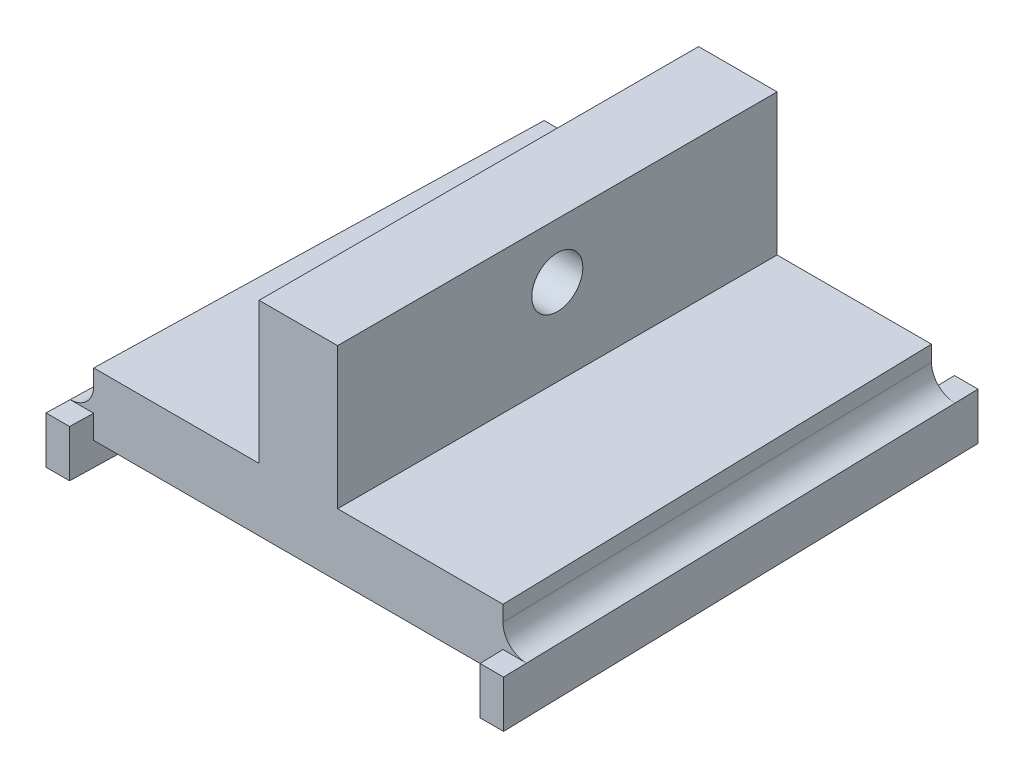
ISO-10303-21;
HEADER;
FILE_DESCRIPTION(('STEP AP214'),'2;1');
FILE_NAME('part.step','',(''),(''),'','','');
FILE_SCHEMA(('AUTOMOTIVE_DESIGN { 1 0 10303 214 1 1 1 1 }'));
ENDSEC;
DATA;
#1=APPLICATION_CONTEXT('core data for automotive mechanical design processes');
#2=APPLICATION_PROTOCOL_DEFINITION('international standard','automotive_design',2000,#1);
#3=PRODUCT_CONTEXT('',#1,'mechanical');
#4=PRODUCT('Part','Part','',(#3));
#5=PRODUCT_RELATED_PRODUCT_CATEGORY('part','',(#4));
#6=PRODUCT_DEFINITION_FORMATION('','',#4);
#7=PRODUCT_DEFINITION_CONTEXT('part definition',#1,'design');
#8=PRODUCT_DEFINITION('design','',#6,#7);
#9=PRODUCT_DEFINITION_SHAPE('','',#8);
#10=(LENGTH_UNIT() NAMED_UNIT(*) SI_UNIT(.MILLI.,.METRE.));
#11=(NAMED_UNIT(*) PLANE_ANGLE_UNIT() SI_UNIT($,.RADIAN.));
#12=(NAMED_UNIT(*) SI_UNIT($,.STERADIAN.) SOLID_ANGLE_UNIT());
#13=UNCERTAINTY_MEASURE_WITH_UNIT(LENGTH_MEASURE(1.E-05),#10,'distance_accuracy_value','');
#14=(GEOMETRIC_REPRESENTATION_CONTEXT(3) GLOBAL_UNCERTAINTY_ASSIGNED_CONTEXT((#13)) GLOBAL_UNIT_ASSIGNED_CONTEXT((#10,
#11,#12)) REPRESENTATION_CONTEXT('',''));
#15=CARTESIAN_POINT('',(0.,0.,0.));
#16=DIRECTION('',(0.,0.,1.));
#17=DIRECTION('',(1.,0.,0.));
#18=AXIS2_PLACEMENT_3D('',#15,#16,#17);
#19=CARTESIAN_POINT('',(0.,3.,0.));
#20=DIRECTION('',(0.,-1.,0.));
#21=DIRECTION('',(0.,0.,-1.));
#22=AXIS2_PLACEMENT_3D('',#19,#20,#21);
#23=PLANE('',#22);
#24=DIRECTION('',(0.0249921911602069,0.,0.999687646408123));
#25=VECTOR('',#24,1.);
#26=CARTESIAN_POINT('',(10.9965641104894,3.,-0.274914102762275));
#27=LINE('',#26,#25);
#28=CARTESIAN_POINT('',(11.2034369630584,3.,8.));
#29=VERTEX_POINT('',#28);
#30=CARTESIAN_POINT('',(11.2784369630585,3.,11.));
#31=VERTEX_POINT('',#30);
#32=EDGE_CURVE('E219',#29,#31,#27,.T.);
#33=ORIENTED_EDGE('',*,*,#32,.F.);
#34=DIRECTION('',(-1.,0.,0.));
#35=VECTOR('',#34,1.);
#36=CARTESIAN_POINT('',(0.,3.,8.));
#37=LINE('',#36,#35);
#38=CARTESIAN_POINT('',(8.20249960949705,3.,8.));
#39=VERTEX_POINT('',#38);
#40=EDGE_CURVE('E406',#29,#39,#37,.T.);
#41=ORIENTED_EDGE('',*,*,#40,.T.);
#42=DIRECTION('',(0.0249921911602069,0.,0.999687646408123));
#43=VECTOR('',#42,1.);
#44=CARTESIAN_POINT('',(7.99750117126498,3.,-0.199937529281655));
#45=LINE('',#44,#43);
#46=CARTESIAN_POINT('',(8.27749960949706,3.,11.));
#47=VERTEX_POINT('',#46);
#48=EDGE_CURVE('E212',#39,#47,#45,.T.);
#49=ORIENTED_EDGE('',*,*,#48,.T.);
#50=DIRECTION('',(-1.,0.,0.));
#51=VECTOR('',#50,1.);
#52=CARTESIAN_POINT('',(0.,3.,11.));
#53=LINE('',#52,#51);
#54=EDGE_CURVE('E226',#31,#47,#53,.T.);
#55=ORIENTED_EDGE('',*,*,#54,.F.);
#56=EDGE_LOOP('',(#33,#41,#49,#55));
#57=FACE_BOUND('',#56,.T.);
#58=ADVANCED_FACE('F41',(#57),#23,.F.);
#59=CARTESIAN_POINT('',(0.,3.,0.));
#60=DIRECTION('',(0.,-1.,0.));
#61=DIRECTION('',(0.,0.,-1.));
#62=AXIS2_PLACEMENT_3D('',#59,#60,#61);
#63=PLANE('',#62);
#64=DIRECTION('',(-0.0249921911601995,0.,0.999687646408123));
#65=VECTOR('',#64,1.);
#66=CARTESIAN_POINT('',(-43.7251713773862,3.,-1.0931292844345));
#67=LINE('',#66,#65);
#68=CARTESIAN_POINT('',(-43.952499609497,3.,8.));
#69=VERTEX_POINT('',#68);
#70=CARTESIAN_POINT('',(-44.027499609497,3.,11.));
#71=VERTEX_POINT('',#70);
#72=EDGE_CURVE('E270',#69,#71,#67,.T.);
#73=ORIENTED_EDGE('',*,*,#72,.F.);
#74=DIRECTION('',(-1.,0.,0.));
#75=VECTOR('',#74,1.);
#76=CARTESIAN_POINT('',(0.,3.,8.));
#77=LINE('',#76,#75);
#78=CARTESIAN_POINT('',(-46.9534369630584,3.,8.));
#79=VERTEX_POINT('',#78);
#80=EDGE_CURVE('E64',#69,#79,#77,.T.);
#81=ORIENTED_EDGE('',*,*,#80,.T.);
#82=DIRECTION('',(0.0249921911601994,0.,-0.999687646408123));
#83=VECTOR('',#82,1.);
#84=CARTESIAN_POINT('',(-46.7242343166105,3.,-1.16810585791509));
#85=LINE('',#84,#83);
#86=CARTESIAN_POINT('',(-47.0284369630584,3.,11.));
#87=VERTEX_POINT('',#86);
#88=EDGE_CURVE('E280',#87,#79,#85,.T.);
#89=ORIENTED_EDGE('',*,*,#88,.F.);
#90=DIRECTION('',(-1.,0.,0.));
#91=VECTOR('',#90,1.);
#92=CARTESIAN_POINT('',(0.,3.,11.));
#93=LINE('',#92,#91);
#94=EDGE_CURVE('E275',#71,#87,#93,.T.);
#95=ORIENTED_EDGE('',*,*,#94,.F.);
#96=EDGE_LOOP('',(#73,#81,#89,#95));
#97=FACE_BOUND('',#96,.T.);
#98=ADVANCED_FACE('F469',(#97),#63,.F.);
#99=CARTESIAN_POINT('',(-43.952499609497,8.,8.));
#100=DIRECTION('',(-0.999687646408123,0.,-0.0249921911601993));
#101=DIRECTION('',(-0.0249921911601993,0.,0.999687646408123));
#102=AXIS2_PLACEMENT_3D('',#99,#100,#101);
#103=PLANE('',#102);
#104=DIRECTION('',(0.,-1.,0.));
#105=VECTOR('',#104,1.);
#106=CARTESIAN_POINT('',(-42.5524996094972,8.,-48.));
#107=LINE('',#106,#105);
#108=CARTESIAN_POINT('',(-42.5524996094972,8.,-48.));
#109=VERTEX_POINT('',#108);
#110=CARTESIAN_POINT('',(-42.5524996094972,6.,-48.));
#111=VERTEX_POINT('',#110);
#112=EDGE_CURVE('E382',#109,#111,#107,.T.);
#113=ORIENTED_EDGE('',*,*,#112,.T.);
#114=DIRECTION('',(-0.0249921911601993,0.,0.999687646408123));
#115=VECTOR('',#114,1.);
#116=CARTESIAN_POINT('',(-43.952499609497,6.,8.));
#117=LINE('',#116,#115);
#118=CARTESIAN_POINT('',(-43.952499609497,6.,8.));
#119=VERTEX_POINT('',#118);
#120=EDGE_CURVE('E381',#111,#119,#117,.T.);
#121=ORIENTED_EDGE('',*,*,#120,.T.);
#122=DIRECTION('',(0.,-1.,0.));
#123=VECTOR('',#122,1.);
#124=CARTESIAN_POINT('',(-43.952499609497,8.,8.));
#125=LINE('',#124,#123);
#126=CARTESIAN_POINT('',(-43.952499609497,8.,8.));
#127=VERTEX_POINT('',#126);
#128=EDGE_CURVE('E387',#127,#119,#125,.T.);
#129=ORIENTED_EDGE('',*,*,#128,.F.);
#130=DIRECTION('',(0.0249921911601993,0.,-0.999687646408123));
#131=VECTOR('',#130,1.);
#132=CARTESIAN_POINT('',(-43.952499609497,8.,8.));
#133=LINE('',#132,#131);
#134=EDGE_CURVE('E353',#127,#109,#133,.T.);
#135=ORIENTED_EDGE('',*,*,#134,.T.);
#136=EDGE_LOOP('',(#113,#121,#129,#135));
#137=FACE_BOUND('',#136,.T.);
#138=ADVANCED_FACE('F481',(#137),#103,.T.);
#139=CARTESIAN_POINT('',(0.,8.,0.));
#140=DIRECTION('',(0.,-1.,0.));
#141=DIRECTION('',(0.,0.,-1.));
#142=AXIS2_PLACEMENT_3D('',#139,#140,#141);
#143=PLANE('',#142);
#144=DIRECTION('',(0.,0.,1.));
#145=VECTOR('',#144,1.);
#146=CARTESIAN_POINT('',(-22.8750000000002,8.,8.));
#147=LINE('',#146,#145);
#148=CARTESIAN_POINT('',(-22.8750000000002,8.,-48.));
#149=VERTEX_POINT('',#148);
#150=CARTESIAN_POINT('',(-22.8750000000002,8.,8.));
#151=VERTEX_POINT('',#150);
#152=EDGE_CURVE('E305',#149,#151,#147,.T.);
#153=ORIENTED_EDGE('',*,*,#152,.F.);
#154=DIRECTION('',(1.,0.,0.));
#155=VECTOR('',#154,1.);
#156=CARTESIAN_POINT('',(-42.5524996094972,8.,-48.));
#157=LINE('',#156,#155);
#158=EDGE_CURVE('E358',#109,#149,#157,.T.);
#159=ORIENTED_EDGE('',*,*,#158,.F.);
#160=ORIENTED_EDGE('',*,*,#134,.F.);
#161=DIRECTION('',(-1.,0.,0.));
#162=VECTOR('',#161,1.);
#163=CARTESIAN_POINT('',(8.20249960949705,8.,8.));
#164=LINE('',#163,#162);
#165=EDGE_CURVE('E347',#151,#127,#164,.T.);
#166=ORIENTED_EDGE('',*,*,#165,.F.);
#167=EDGE_LOOP('',(#153,#159,#160,#166));
#168=FACE_BOUND('',#167,.T.);
#169=ADVANCED_FACE('F486',(#168),#143,.F.);
#170=DIRECTION('',(0.,0.,-1.));
#171=VECTOR('',#170,1.);
#172=CARTESIAN_POINT('',(-12.8750000000002,8.,-48.));
#173=LINE('',#172,#171);
#174=CARTESIAN_POINT('',(-12.8750000000002,8.,8.));
#175=VERTEX_POINT('',#174);
#176=CARTESIAN_POINT('',(-12.8750000000002,8.,-48.));
#177=VERTEX_POINT('',#176);
#178=EDGE_CURVE('E311',#175,#177,#173,.T.);
#179=ORIENTED_EDGE('',*,*,#178,.F.);
#180=CARTESIAN_POINT('',(8.20249960949705,8.,8.));
#181=VERTEX_POINT('',#180);
#182=EDGE_CURVE('E349',#181,#175,#164,.T.);
#183=ORIENTED_EDGE('',*,*,#182,.F.);
#184=DIRECTION('',(0.0249921911602069,0.,0.999687646408123));
#185=VECTOR('',#184,1.);
#186=CARTESIAN_POINT('',(6.80249960949684,8.,-48.));
#187=LINE('',#186,#185);
#188=CARTESIAN_POINT('',(6.80249960949684,8.,-48.));
#189=VERTEX_POINT('',#188);
#190=EDGE_CURVE('E343',#189,#181,#187,.T.);
#191=ORIENTED_EDGE('',*,*,#190,.F.);
#192=EDGE_CURVE('E357',#177,#189,#157,.T.);
#193=ORIENTED_EDGE('',*,*,#192,.F.);
#194=EDGE_LOOP('',(#179,#183,#191,#193));
#195=FACE_BOUND('',#194,.T.);
#196=ADVANCED_FACE('F501',(#195),#143,.F.);
#197=CARTESIAN_POINT('',(6.80249960949684,8.,-48.));
#198=DIRECTION('',(0.999687646408123,0.,-0.0249921911602069));
#199=DIRECTION('',(-0.0249921911602069,0.,-0.999687646408123));
#200=AXIS2_PLACEMENT_3D('',#197,#198,#199);
#201=PLANE('',#200);
#202=DIRECTION('',(0.,-1.,0.));
#203=VECTOR('',#202,1.);
#204=CARTESIAN_POINT('',(8.20249960949705,8.,8.));
#205=LINE('',#204,#203);
#206=CARTESIAN_POINT('',(8.20249960949705,6.,8.));
#207=VERTEX_POINT('',#206);
#208=EDGE_CURVE('E392',#181,#207,#205,.T.);
#209=ORIENTED_EDGE('',*,*,#208,.T.);
#210=DIRECTION('',(0.0249921911602069,0.,0.999687646408123));
#211=VECTOR('',#210,1.);
#212=CARTESIAN_POINT('',(6.80249960949684,6.,-48.));
#213=LINE('',#212,#211);
#214=CARTESIAN_POINT('',(6.80249960949684,6.,-48.));
#215=VERTEX_POINT('',#214);
#216=EDGE_CURVE('E409',#207,#215,#213,.F.);
#217=ORIENTED_EDGE('',*,*,#216,.T.);
#218=DIRECTION('',(0.,-1.,0.));
#219=VECTOR('',#218,1.);
#220=CARTESIAN_POINT('',(6.80249960949684,8.,-48.));
#221=LINE('',#220,#219);
#222=EDGE_CURVE('E377',#189,#215,#221,.T.);
#223=ORIENTED_EDGE('',*,*,#222,.F.);
#224=ORIENTED_EDGE('',*,*,#190,.T.);
#225=EDGE_LOOP('',(#209,#217,#223,#224));
#226=FACE_BOUND('',#225,.T.);
#227=ADVANCED_FACE('F427',(#226),#201,.T.);
#228=CARTESIAN_POINT('',(-42.5524996094972,8.,-48.));
#229=DIRECTION('',(0.,0.,-1.));
#230=DIRECTION('',(-1.,0.,0.));
#231=AXIS2_PLACEMENT_3D('',#228,#229,#230);
#232=PLANE('',#231);
#233=DIRECTION('',(1.,0.,0.));
#234=VECTOR('',#233,1.);
#235=CARTESIAN_POINT('',(-42.5524996094972,0.,-48.));
#236=LINE('',#235,#234);
#237=CARTESIAN_POINT('',(-42.5524996094972,0.,-48.));
#238=VERTEX_POINT('',#237);
#239=CARTESIAN_POINT('',(6.80249960949684,0.,-48.));
#240=VERTEX_POINT('',#239);
#241=EDGE_CURVE('E348',#238,#240,#236,.T.);
#242=ORIENTED_EDGE('',*,*,#241,.F.);
#243=CARTESIAN_POINT('',(-42.5524996094972,3.,-48.));
#244=VERTEX_POINT('',#243);
#245=EDGE_CURVE('E386',#244,#238,#107,.T.);
#246=ORIENTED_EDGE('',*,*,#245,.F.);
#247=DIRECTION('',(1.,0.,0.));
#248=VECTOR('',#247,1.);
#249=CARTESIAN_POINT('',(0.,3.,-48.));
#250=LINE('',#249,#248);
#251=CARTESIAN_POINT('',(-45.5534369630586,3.,-48.));
#252=VERTEX_POINT('',#251);
#253=EDGE_CURVE('E399',#252,#244,#250,.T.);
#254=ORIENTED_EDGE('',*,*,#253,.F.);
#255=CARTESIAN_POINT('',(-45.5534369630586,6.,-48.));
#256=DIRECTION('',(0.,0.,-1.));
#257=DIRECTION('',(-1.,0.,0.));
#258=AXIS2_PLACEMENT_3D('',#255,#256,#257);
#259=ELLIPSE('',#258,3.00093735356138,3.);
#260=EDGE_CURVE('E415',#252,#111,#259,.F.);
#261=ORIENTED_EDGE('',*,*,#260,.T.);
#262=ORIENTED_EDGE('',*,*,#112,.F.);
#263=ORIENTED_EDGE('',*,*,#158,.T.);
#264=DIRECTION('',(0.,-1.,0.));
#265=VECTOR('',#264,1.);
#266=CARTESIAN_POINT('',(-22.8750000000002,26.,-48.));
#267=LINE('',#266,#265);
#268=CARTESIAN_POINT('',(-22.8750000000002,26.,-48.));
#269=VERTEX_POINT('',#268);
#270=EDGE_CURVE('E320',#269,#149,#267,.T.);
#271=ORIENTED_EDGE('',*,*,#270,.F.);
#272=DIRECTION('',(-1.,0.,0.));
#273=VECTOR('',#272,1.);
#274=CARTESIAN_POINT('',(-22.8750000000002,26.,-48.));
#275=LINE('',#274,#273);
#276=CARTESIAN_POINT('',(-12.8750000000002,26.,-48.));
#277=VERTEX_POINT('',#276);
#278=EDGE_CURVE('E317',#277,#269,#275,.T.);
#279=ORIENTED_EDGE('',*,*,#278,.F.);
#280=DIRECTION('',(0.,-1.,0.));
#281=VECTOR('',#280,1.);
#282=CARTESIAN_POINT('',(-12.8750000000002,26.,-48.));
#283=LINE('',#282,#281);
#284=EDGE_CURVE('E330',#277,#177,#283,.T.);
#285=ORIENTED_EDGE('',*,*,#284,.T.);
#286=ORIENTED_EDGE('',*,*,#192,.T.);
#287=ORIENTED_EDGE('',*,*,#222,.T.);
#288=CARTESIAN_POINT('',(9.80343696305823,6.,-48.));
#289=DIRECTION('',(0.,0.,-1.));
#290=DIRECTION('',(1.,0.,0.));
#291=AXIS2_PLACEMENT_3D('',#288,#289,#290);
#292=ELLIPSE('',#291,3.00093735356138,3.);
#293=CARTESIAN_POINT('',(9.80343696305822,3.,-48.));
#294=VERTEX_POINT('',#293);
#295=EDGE_CURVE('E11',#215,#294,#292,.F.);
#296=ORIENTED_EDGE('',*,*,#295,.T.);
#297=DIRECTION('',(1.,0.,0.));
#298=VECTOR('',#297,1.);
#299=CARTESIAN_POINT('',(0.,3.,-48.));
#300=LINE('',#299,#298);
#301=CARTESIAN_POINT('',(6.80249960949684,3.,-48.));
#302=VERTEX_POINT('',#301);
#303=EDGE_CURVE('E56',#302,#294,#300,.T.);
#304=ORIENTED_EDGE('',*,*,#303,.F.);
#305=EDGE_CURVE('E209',#302,#240,#221,.T.);
#306=ORIENTED_EDGE('',*,*,#305,.T.);
#307=EDGE_LOOP('',(#242,#246,#254,#261,#262,#263,#271,#279,#285,#286,#287,#296,#304,#306));
#308=FACE_BOUND('',#307,.T.);
#309=ADVANCED_FACE('F433',(#308),#232,.T.);
#310=CARTESIAN_POINT('',(8.20249960949705,8.,8.));
#311=DIRECTION('',(0.,0.,1.));
#312=DIRECTION('',(1.,0.,0.));
#313=AXIS2_PLACEMENT_3D('',#310,#311,#312);
#314=PLANE('',#313);
#315=DIRECTION('',(-1.,0.,0.));
#316=VECTOR('',#315,1.);
#317=CARTESIAN_POINT('',(8.20249960949705,0.,8.));
#318=LINE('',#317,#316);
#319=CARTESIAN_POINT('',(8.20249960949705,0.,8.));
#320=VERTEX_POINT('',#319);
#321=CARTESIAN_POINT('',(-43.952499609497,0.,8.));
#322=VERTEX_POINT('',#321);
#323=EDGE_CURVE('E366',#320,#322,#318,.T.);
#324=ORIENTED_EDGE('',*,*,#323,.F.);
#325=EDGE_CURVE('E362',#39,#320,#205,.T.);
#326=ORIENTED_EDGE('',*,*,#325,.F.);
#327=ORIENTED_EDGE('',*,*,#40,.F.);
#328=CARTESIAN_POINT('',(11.2034369630584,6.,8.));
#329=DIRECTION('',(0.,0.,1.));
#330=DIRECTION('',(1.,0.,0.));
#331=AXIS2_PLACEMENT_3D('',#328,#329,#330);
#332=ELLIPSE('',#331,3.00093735356138,3.);
#333=EDGE_CURVE('E50',#29,#207,#332,.F.);
#334=ORIENTED_EDGE('',*,*,#333,.T.);
#335=ORIENTED_EDGE('',*,*,#208,.F.);
#336=ORIENTED_EDGE('',*,*,#182,.T.);
#337=DIRECTION('',(0.,-1.,0.));
#338=VECTOR('',#337,1.);
#339=CARTESIAN_POINT('',(-12.8750000000002,26.,8.));
#340=LINE('',#339,#338);
#341=CARTESIAN_POINT('',(-12.8750000000002,26.,8.));
#342=VERTEX_POINT('',#341);
#343=EDGE_CURVE('E334',#342,#175,#340,.T.);
#344=ORIENTED_EDGE('',*,*,#343,.F.);
#345=DIRECTION('',(1.,0.,0.));
#346=VECTOR('',#345,1.);
#347=CARTESIAN_POINT('',(-12.8750000000002,26.,8.));
#348=LINE('',#347,#346);
#349=CARTESIAN_POINT('',(-22.8750000000002,26.,8.));
#350=VERTEX_POINT('',#349);
#351=EDGE_CURVE('E310',#350,#342,#348,.T.);
#352=ORIENTED_EDGE('',*,*,#351,.F.);
#353=DIRECTION('',(0.,-1.,0.));
#354=VECTOR('',#353,1.);
#355=CARTESIAN_POINT('',(-22.8750000000002,26.,8.));
#356=LINE('',#355,#354);
#357=EDGE_CURVE('E338',#350,#151,#356,.T.);
#358=ORIENTED_EDGE('',*,*,#357,.T.);
#359=ORIENTED_EDGE('',*,*,#165,.T.);
#360=ORIENTED_EDGE('',*,*,#128,.T.);
#361=CARTESIAN_POINT('',(-46.9534369630584,6.,8.));
#362=DIRECTION('',(0.,0.,1.));
#363=DIRECTION('',(-1.,0.,0.));
#364=AXIS2_PLACEMENT_3D('',#361,#362,#363);
#365=ELLIPSE('',#364,3.00093735356138,3.);
#366=EDGE_CURVE('E412',#119,#79,#365,.F.);
#367=ORIENTED_EDGE('',*,*,#366,.T.);
#368=ORIENTED_EDGE('',*,*,#80,.F.);
#369=EDGE_CURVE('E391',#69,#322,#125,.T.);
#370=ORIENTED_EDGE('',*,*,#369,.T.);
#371=EDGE_LOOP('',(#324,#326,#327,#334,#335,#336,#344,#352,#358,#359,#360,#367,#368,#370));
#372=FACE_BOUND('',#371,.T.);
#373=ADVANCED_FACE('F419',(#372),#314,.T.);
#374=CARTESIAN_POINT('',(0.,0.,0.));
#375=DIRECTION('',(0.,-1.,0.));
#376=DIRECTION('',(0.,0.,-1.));
#377=AXIS2_PLACEMENT_3D('',#374,#375,#376);
#378=PLANE('',#377);
#379=DIRECTION('',(0.0249921911602069,0.,0.999687646408123));
#380=VECTOR('',#379,1.);
#381=CARTESIAN_POINT('',(6.80249960949684,0.,-48.));
#382=LINE('',#381,#380);
#383=EDGE_CURVE('E342',#240,#320,#382,.T.);
#384=ORIENTED_EDGE('',*,*,#383,.T.);
#385=ORIENTED_EDGE('',*,*,#323,.T.);
#386=DIRECTION('',(0.0249921911601993,0.,-0.999687646408123));
#387=VECTOR('',#386,1.);
#388=CARTESIAN_POINT('',(-43.952499609497,0.,8.));
#389=LINE('',#388,#387);
#390=EDGE_CURVE('E370',#322,#238,#389,.T.);
#391=ORIENTED_EDGE('',*,*,#390,.T.);
#392=ORIENTED_EDGE('',*,*,#241,.T.);
#393=EDGE_LOOP('',(#384,#385,#391,#392));
#394=FACE_BOUND('',#393,.T.);
#395=ADVANCED_FACE('F560',(#394),#378,.T.);
#396=CARTESIAN_POINT('',(-22.8750000000002,26.,8.));
#397=DIRECTION('',(1.,0.,0.));
#398=DIRECTION('',(0.,0.,-1.));
#399=AXIS2_PLACEMENT_3D('',#396,#397,#398);
#400=PLANE('',#399);
#401=CARTESIAN_POINT('',(-22.8750000000002,19.,-20.));
#402=DIRECTION('',(1.,0.,0.));
#403=DIRECTION('',(0.,0.,-1.));
#404=AXIS2_PLACEMENT_3D('',#401,#402,#403);
#405=CIRCLE('',#404,3.25);
#406=CARTESIAN_POINT('',(-22.8750000000002,19.,-23.25));
#407=VERTEX_POINT('',#406);
#408=EDGE_CURVE('E301',#407,#407,#405,.T.);
#409=ORIENTED_EDGE('',*,*,#408,.T.);
#410=EDGE_LOOP('',(#409));
#411=FACE_BOUND('',#410,.T.);
#412=ORIENTED_EDGE('',*,*,#152,.T.);
#413=ORIENTED_EDGE('',*,*,#357,.F.);
#414=DIRECTION('',(0.,0.,1.));
#415=VECTOR('',#414,1.);
#416=CARTESIAN_POINT('',(-22.8750000000002,26.,8.));
#417=LINE('',#416,#415);
#418=EDGE_CURVE('E306',#269,#350,#417,.T.);
#419=ORIENTED_EDGE('',*,*,#418,.F.);
#420=ORIENTED_EDGE('',*,*,#270,.T.);
#421=EDGE_LOOP('',(#412,#413,#419,#420));
#422=FACE_BOUND('',#421,.T.);
#423=ADVANCED_FACE('F491',(#411,#422),#400,.F.);
#424=CARTESIAN_POINT('',(-12.8750000000002,26.,-48.));
#425=DIRECTION('',(-1.,0.,0.));
#426=DIRECTION('',(0.,0.,1.));
#427=AXIS2_PLACEMENT_3D('',#424,#425,#426);
#428=PLANE('',#427);
#429=CARTESIAN_POINT('',(-12.8750000000002,19.,-20.));
#430=DIRECTION('',(1.,0.,0.));
#431=DIRECTION('',(0.,0.,-1.));
#432=AXIS2_PLACEMENT_3D('',#429,#430,#431);
#433=CIRCLE('',#432,3.25);
#434=CARTESIAN_POINT('',(-12.8750000000002,19.,-23.25));
#435=VERTEX_POINT('',#434);
#436=EDGE_CURVE('E289',#435,#435,#433,.T.);
#437=ORIENTED_EDGE('',*,*,#436,.F.);
#438=EDGE_LOOP('',(#437));
#439=FACE_BOUND('',#438,.T.);
#440=ORIENTED_EDGE('',*,*,#178,.T.);
#441=ORIENTED_EDGE('',*,*,#284,.F.);
#442=DIRECTION('',(0.,0.,-1.));
#443=VECTOR('',#442,1.);
#444=CARTESIAN_POINT('',(-12.8750000000002,26.,-48.));
#445=LINE('',#444,#443);
#446=EDGE_CURVE('E314',#342,#277,#445,.T.);
#447=ORIENTED_EDGE('',*,*,#446,.F.);
#448=ORIENTED_EDGE('',*,*,#343,.T.);
#449=EDGE_LOOP('',(#440,#441,#447,#448));
#450=FACE_BOUND('',#449,.T.);
#451=ADVANCED_FACE('F499',(#439,#450),#428,.F.);
#452=CARTESIAN_POINT('',(0.,26.,0.));
#453=DIRECTION('',(0.,-1.,0.));
#454=DIRECTION('',(0.,0.,-1.));
#455=AXIS2_PLACEMENT_3D('',#452,#453,#454);
#456=PLANE('',#455);
#457=ORIENTED_EDGE('',*,*,#418,.T.);
#458=ORIENTED_EDGE('',*,*,#351,.T.);
#459=ORIENTED_EDGE('',*,*,#446,.T.);
#460=ORIENTED_EDGE('',*,*,#278,.T.);
#461=EDGE_LOOP('',(#457,#458,#459,#460));
#462=FACE_BOUND('',#461,.T.);
#463=ADVANCED_FACE('F494',(#462),#456,.F.);
#464=CARTESIAN_POINT('',(-30.8750000000002,19.,-20.));
#465=DIRECTION('',(1.,0.,0.));
#466=DIRECTION('',(0.,0.,-1.));
#467=AXIS2_PLACEMENT_3D('',#464,#465,#466);
#468=CYLINDRICAL_SURFACE('',#467,3.25);
#469=ORIENTED_EDGE('',*,*,#436,.T.);
#470=EDGE_LOOP('',(#469));
#471=FACE_BOUND('',#470,.T.);
#472=ORIENTED_EDGE('',*,*,#408,.F.);
#473=EDGE_LOOP('',(#472));
#474=FACE_BOUND('',#473,.T.);
#475=ADVANCED_FACE('F548',(#471,#474),#468,.F.);
#476=CARTESIAN_POINT('',(-43.7251713773862,3.,-1.0931292844345));
#477=DIRECTION('',(0.999687646408123,0.,0.0249921911601995));
#478=DIRECTION('',(0.0249921911601995,0.,-0.999687646408123));
#479=AXIS2_PLACEMENT_3D('',#476,#477,#478);
#480=PLANE('',#479);
#481=ORIENTED_EDGE('',*,*,#369,.F.);
#482=ORIENTED_EDGE('',*,*,#72,.T.);
#483=DIRECTION('',(0.,-1.,0.));
#484=VECTOR('',#483,1.);
#485=CARTESIAN_POINT('',(-44.027499609497,3.,11.));
#486=LINE('',#485,#484);
#487=CARTESIAN_POINT('',(-44.027499609497,-3.,11.));
#488=VERTEX_POINT('',#487);
#489=EDGE_CURVE('E293',#71,#488,#486,.T.);
#490=ORIENTED_EDGE('',*,*,#489,.T.);
#491=DIRECTION('',(-0.0249921911601995,0.,0.999687646408123));
#492=VECTOR('',#491,1.);
#493=CARTESIAN_POINT('',(-43.7251713773862,-3.,-1.0931292844345));
#494=LINE('',#493,#492);
#495=CARTESIAN_POINT('',(-42.4774996094972,-3.,-51.));
#496=VERTEX_POINT('',#495);
#497=EDGE_CURVE('E254',#496,#488,#494,.T.);
#498=ORIENTED_EDGE('',*,*,#497,.F.);
#499=DIRECTION('',(0.,-1.,0.));
#500=VECTOR('',#499,1.);
#501=CARTESIAN_POINT('',(-42.4774996094972,3.,-51.));
#502=LINE('',#501,#500);
#503=CARTESIAN_POINT('',(-42.4774996094972,3.,-51.));
#504=VERTEX_POINT('',#503);
#505=EDGE_CURVE('E284',#504,#496,#502,.T.);
#506=ORIENTED_EDGE('',*,*,#505,.F.);
#507=EDGE_CURVE('E271',#504,#244,#67,.T.);
#508=ORIENTED_EDGE('',*,*,#507,.T.);
#509=ORIENTED_EDGE('',*,*,#245,.T.);
#510=ORIENTED_EDGE('',*,*,#390,.F.);
#511=EDGE_LOOP('',(#481,#482,#490,#498,#506,#508,#509,#510));
#512=FACE_BOUND('',#511,.T.);
#513=ADVANCED_FACE('F461',(#512),#480,.T.);
#514=CARTESIAN_POINT('',(0.,3.,-51.));
#515=DIRECTION('',(0.,0.,-1.));
#516=DIRECTION('',(-1.,0.,0.));
#517=AXIS2_PLACEMENT_3D('',#514,#515,#516);
#518=PLANE('',#517);
#519=DIRECTION('',(1.,0.,0.));
#520=VECTOR('',#519,1.);
#521=CARTESIAN_POINT('',(0.,-3.,-51.));
#522=LINE('',#521,#520);
#523=CARTESIAN_POINT('',(-45.4784369630586,-3.,-51.));
#524=VERTEX_POINT('',#523);
#525=EDGE_CURVE('E202',#524,#496,#522,.T.);
#526=ORIENTED_EDGE('',*,*,#525,.F.);
#527=DIRECTION('',(0.,-1.,0.));
#528=VECTOR('',#527,1.);
#529=CARTESIAN_POINT('',(-45.4784369630586,3.,-51.));
#530=LINE('',#529,#528);
#531=CARTESIAN_POINT('',(-45.4784369630586,3.,-51.));
#532=VERTEX_POINT('',#531);
#533=EDGE_CURVE('E286',#532,#524,#530,.T.);
#534=ORIENTED_EDGE('',*,*,#533,.F.);
#535=DIRECTION('',(1.,0.,0.));
#536=VECTOR('',#535,1.);
#537=CARTESIAN_POINT('',(0.,3.,-51.));
#538=LINE('',#537,#536);
#539=EDGE_CURVE('E266',#532,#504,#538,.T.);
#540=ORIENTED_EDGE('',*,*,#539,.T.);
#541=ORIENTED_EDGE('',*,*,#505,.T.);
#542=EDGE_LOOP('',(#526,#534,#540,#541));
#543=FACE_BOUND('',#542,.T.);
#544=ADVANCED_FACE('F543',(#543),#518,.T.);
#545=CARTESIAN_POINT('',(-46.7242343166105,3.,-1.16810585791509));
#546=DIRECTION('',(-0.999687646408123,0.,-0.0249921911601994));
#547=DIRECTION('',(-0.0249921911601994,0.,0.999687646408123));
#548=AXIS2_PLACEMENT_3D('',#545,#546,#547);
#549=PLANE('',#548);
#550=DIRECTION('',(0.0249921911601994,0.,-0.999687646408123));
#551=VECTOR('',#550,1.);
#552=CARTESIAN_POINT('',(-46.7242343166105,-3.,-1.16810585791509));
#553=LINE('',#552,#551);
#554=CARTESIAN_POINT('',(-47.0284369630584,-3.,11.));
#555=VERTEX_POINT('',#554);
#556=EDGE_CURVE('E262',#555,#524,#553,.T.);
#557=ORIENTED_EDGE('',*,*,#556,.F.);
#558=DIRECTION('',(0.,-1.,0.));
#559=VECTOR('',#558,1.);
#560=CARTESIAN_POINT('',(-47.0284369630584,3.,11.));
#561=LINE('',#560,#559);
#562=EDGE_CURVE('E290',#87,#555,#561,.T.);
#563=ORIENTED_EDGE('',*,*,#562,.F.);
#564=ORIENTED_EDGE('',*,*,#88,.T.);
#565=EDGE_CURVE('E285',#79,#252,#85,.T.);
#566=ORIENTED_EDGE('',*,*,#565,.T.);
#567=EDGE_CURVE('E279',#252,#532,#85,.T.);
#568=ORIENTED_EDGE('',*,*,#567,.T.);
#569=ORIENTED_EDGE('',*,*,#533,.T.);
#570=EDGE_LOOP('',(#557,#563,#564,#566,#568,#569));
#571=FACE_BOUND('',#570,.T.);
#572=ADVANCED_FACE('F473',(#571),#549,.T.);
#573=CARTESIAN_POINT('',(0.,3.,11.));
#574=DIRECTION('',(0.,0.,1.));
#575=DIRECTION('',(1.,0.,0.));
#576=AXIS2_PLACEMENT_3D('',#573,#574,#575);
#577=PLANE('',#576);
#578=DIRECTION('',(-1.,0.,0.));
#579=VECTOR('',#578,1.);
#580=CARTESIAN_POINT('',(0.,-3.,11.));
#581=LINE('',#580,#579);
#582=EDGE_CURVE('E258',#488,#555,#581,.T.);
#583=ORIENTED_EDGE('',*,*,#582,.F.);
#584=ORIENTED_EDGE('',*,*,#489,.F.);
#585=ORIENTED_EDGE('',*,*,#94,.T.);
#586=ORIENTED_EDGE('',*,*,#562,.T.);
#587=EDGE_LOOP('',(#583,#584,#585,#586));
#588=FACE_BOUND('',#587,.T.);
#589=ADVANCED_FACE('F467',(#588),#577,.T.);
#590=ORIENTED_EDGE('',*,*,#567,.F.);
#591=ORIENTED_EDGE('',*,*,#253,.T.);
#592=ORIENTED_EDGE('',*,*,#507,.F.);
#593=ORIENTED_EDGE('',*,*,#539,.F.);
#594=EDGE_LOOP('',(#590,#591,#592,#593));
#595=FACE_BOUND('',#594,.T.);
#596=ADVANCED_FACE('F517',(#595),#63,.F.);
#597=CARTESIAN_POINT('',(0.,-3.,0.));
#598=DIRECTION('',(0.,-1.,0.));
#599=DIRECTION('',(0.,0.,-1.));
#600=AXIS2_PLACEMENT_3D('',#597,#598,#599);
#601=PLANE('',#600);
#602=ORIENTED_EDGE('',*,*,#525,.T.);
#603=ORIENTED_EDGE('',*,*,#497,.T.);
#604=ORIENTED_EDGE('',*,*,#582,.T.);
#605=ORIENTED_EDGE('',*,*,#556,.T.);
#606=EDGE_LOOP('',(#602,#603,#604,#605));
#607=FACE_BOUND('',#606,.T.);
#608=ADVANCED_FACE('F535',(#607),#601,.T.);
#609=CARTESIAN_POINT('',(7.99750117126498,-3.,-0.199937529281655));
#610=DIRECTION('',(-0.999687646408122,0.,0.0249921911602069));
#611=DIRECTION('',(0.0249921911602069,0.,0.999687646408123));
#612=AXIS2_PLACEMENT_3D('',#609,#610,#611);
#613=PLANE('',#612);
#614=ORIENTED_EDGE('',*,*,#305,.F.);
#615=CARTESIAN_POINT('',(6.72749960949683,3.,-51.));
#616=VERTEX_POINT('',#615);
#617=EDGE_CURVE('E206',#616,#302,#45,.T.);
#618=ORIENTED_EDGE('',*,*,#617,.F.);
#619=DIRECTION('',(0.,1.,0.));
#620=VECTOR('',#619,1.);
#621=CARTESIAN_POINT('',(6.72749960949683,-3.,-51.));
#622=LINE('',#621,#620);
#623=CARTESIAN_POINT('',(6.72749960949683,-3.,-51.));
#624=VERTEX_POINT('',#623);
#625=EDGE_CURVE('E191',#624,#616,#622,.T.);
#626=ORIENTED_EDGE('',*,*,#625,.F.);
#627=DIRECTION('',(0.0249921911602069,0.,0.999687646408123));
#628=VECTOR('',#627,1.);
#629=CARTESIAN_POINT('',(7.99750117126498,-3.,-0.199937529281655));
#630=LINE('',#629,#628);
#631=CARTESIAN_POINT('',(8.27749960949706,-3.,11.));
#632=VERTEX_POINT('',#631);
#633=EDGE_CURVE('E230',#624,#632,#630,.T.);
#634=ORIENTED_EDGE('',*,*,#633,.T.);
#635=DIRECTION('',(0.,1.,0.));
#636=VECTOR('',#635,1.);
#637=CARTESIAN_POINT('',(8.27749960949706,-3.,11.));
#638=LINE('',#637,#636);
#639=EDGE_CURVE('E241',#632,#47,#638,.T.);
#640=ORIENTED_EDGE('',*,*,#639,.T.);
#641=ORIENTED_EDGE('',*,*,#48,.F.);
#642=ORIENTED_EDGE('',*,*,#325,.T.);
#643=ORIENTED_EDGE('',*,*,#383,.F.);
#644=EDGE_LOOP('',(#614,#618,#626,#634,#640,#641,#642,#643));
#645=FACE_BOUND('',#644,.T.);
#646=ADVANCED_FACE('F207',(#645),#613,.T.);
#647=CARTESIAN_POINT('',(0.,-3.,-51.));
#648=DIRECTION('',(0.,0.,1.));
#649=DIRECTION('',(1.,0.,0.));
#650=AXIS2_PLACEMENT_3D('',#647,#648,#649);
#651=PLANE('',#650);
#652=ORIENTED_EDGE('',*,*,#625,.T.);
#653=DIRECTION('',(1.,0.,0.));
#654=VECTOR('',#653,1.);
#655=CARTESIAN_POINT('',(0.,3.,-51.));
#656=LINE('',#655,#654);
#657=CARTESIAN_POINT('',(9.72843696305821,3.,-51.));
#658=VERTEX_POINT('',#657);
#659=EDGE_CURVE('E196',#616,#658,#656,.T.);
#660=ORIENTED_EDGE('',*,*,#659,.T.);
#661=DIRECTION('',(0.,1.,0.));
#662=VECTOR('',#661,1.);
#663=CARTESIAN_POINT('',(9.72843696305821,-3.,-51.));
#664=LINE('',#663,#662);
#665=CARTESIAN_POINT('',(9.72843696305821,-3.,-51.));
#666=VERTEX_POINT('',#665);
#667=EDGE_CURVE('E203',#666,#658,#664,.T.);
#668=ORIENTED_EDGE('',*,*,#667,.F.);
#669=DIRECTION('',(1.,0.,0.));
#670=VECTOR('',#669,1.);
#671=CARTESIAN_POINT('',(0.,-3.,-51.));
#672=LINE('',#671,#670);
#673=EDGE_CURVE('E197',#624,#666,#672,.T.);
#674=ORIENTED_EDGE('',*,*,#673,.F.);
#675=EDGE_LOOP('',(#652,#660,#668,#674));
#676=FACE_BOUND('',#675,.T.);
#677=ADVANCED_FACE('F193',(#676),#651,.F.);
#678=CARTESIAN_POINT('',(10.9965641104894,-3.,-0.274914102762275));
#679=DIRECTION('',(-0.999687646408123,0.,0.0249921911602069));
#680=DIRECTION('',(0.0249921911602069,0.,0.999687646408123));
#681=AXIS2_PLACEMENT_3D('',#678,#679,#680);
#682=PLANE('',#681);
#683=ORIENTED_EDGE('',*,*,#667,.T.);
#684=EDGE_CURVE('E217',#658,#294,#27,.T.);
#685=ORIENTED_EDGE('',*,*,#684,.T.);
#686=EDGE_CURVE('E222',#294,#29,#27,.T.);
#687=ORIENTED_EDGE('',*,*,#686,.T.);
#688=ORIENTED_EDGE('',*,*,#32,.T.);
#689=DIRECTION('',(0.,1.,0.));
#690=VECTOR('',#689,1.);
#691=CARTESIAN_POINT('',(11.2784369630585,-3.,11.));
#692=LINE('',#691,#690);
#693=CARTESIAN_POINT('',(11.2784369630585,-3.,11.));
#694=VERTEX_POINT('',#693);
#695=EDGE_CURVE('E245',#694,#31,#692,.T.);
#696=ORIENTED_EDGE('',*,*,#695,.F.);
#697=DIRECTION('',(0.0249921911602069,0.,0.999687646408123));
#698=VECTOR('',#697,1.);
#699=CARTESIAN_POINT('',(10.9965641104894,-3.,-0.274914102762275));
#700=LINE('',#699,#698);
#701=EDGE_CURVE('E235',#666,#694,#700,.T.);
#702=ORIENTED_EDGE('',*,*,#701,.F.);
#703=EDGE_LOOP('',(#683,#685,#687,#688,#696,#702));
#704=FACE_BOUND('',#703,.T.);
#705=ADVANCED_FACE('F435',(#704),#682,.F.);
#706=CARTESIAN_POINT('',(0.,-3.,11.));
#707=DIRECTION('',(0.,0.,-1.));
#708=DIRECTION('',(-1.,0.,0.));
#709=AXIS2_PLACEMENT_3D('',#706,#707,#708);
#710=PLANE('',#709);
#711=ORIENTED_EDGE('',*,*,#695,.T.);
#712=ORIENTED_EDGE('',*,*,#54,.T.);
#713=ORIENTED_EDGE('',*,*,#639,.F.);
#714=DIRECTION('',(-1.,0.,0.));
#715=VECTOR('',#714,1.);
#716=CARTESIAN_POINT('',(0.,-3.,11.));
#717=LINE('',#716,#715);
#718=EDGE_CURVE('E238',#694,#632,#717,.T.);
#719=ORIENTED_EDGE('',*,*,#718,.F.);
#720=EDGE_LOOP('',(#711,#712,#713,#719));
#721=FACE_BOUND('',#720,.T.);
#722=ADVANCED_FACE('F446',(#721),#710,.F.);
#723=CARTESIAN_POINT('',(0.,-3.,0.));
#724=DIRECTION('',(0.,-1.,0.));
#725=DIRECTION('',(0.,0.,-1.));
#726=AXIS2_PLACEMENT_3D('',#723,#724,#725);
#727=PLANE('',#726);
#728=ORIENTED_EDGE('',*,*,#633,.F.);
#729=ORIENTED_EDGE('',*,*,#673,.T.);
#730=ORIENTED_EDGE('',*,*,#701,.T.);
#731=ORIENTED_EDGE('',*,*,#718,.T.);
#732=EDGE_LOOP('',(#728,#729,#730,#731));
#733=FACE_BOUND('',#732,.T.);
#734=ADVANCED_FACE('F440',(#733),#727,.T.);
#735=ORIENTED_EDGE('',*,*,#617,.T.);
#736=ORIENTED_EDGE('',*,*,#303,.T.);
#737=ORIENTED_EDGE('',*,*,#684,.F.);
#738=ORIENTED_EDGE('',*,*,#659,.F.);
#739=EDGE_LOOP('',(#735,#736,#737,#738));
#740=FACE_BOUND('',#739,.T.);
#741=ADVANCED_FACE('F215',(#740),#23,.F.);
#742=CARTESIAN_POINT('',(-46.9515625487214,6.,7.9250234265194));
#743=DIRECTION('',(-0.0249921911601993,0.,0.999687646408123));
#744=DIRECTION('',(0.999687646408123,0.,0.0249921911601993));
#745=AXIS2_PLACEMENT_3D('',#742,#743,#744);
#746=CYLINDRICAL_SURFACE('',#745,3.);
#747=ORIENTED_EDGE('',*,*,#260,.F.);
#748=ORIENTED_EDGE('',*,*,#565,.F.);
#749=ORIENTED_EDGE('',*,*,#366,.F.);
#750=ORIENTED_EDGE('',*,*,#120,.F.);
#751=EDGE_LOOP('',(#747,#748,#749,#750));
#752=FACE_BOUND('',#751,.T.);
#753=ADVANCED_FACE('F476',(#752),#746,.F.);
#754=CARTESIAN_POINT('',(10.9965641104894,6.,-0.274914102762276));
#755=DIRECTION('',(0.0249921911602069,0.,0.999687646408123));
#756=DIRECTION('',(0.999687646408123,0.,-0.0249921911602069));
#757=AXIS2_PLACEMENT_3D('',#754,#755,#756);
#758=CYLINDRICAL_SURFACE('',#757,3.);
#759=ORIENTED_EDGE('',*,*,#295,.F.);
#760=ORIENTED_EDGE('',*,*,#216,.F.);
#761=ORIENTED_EDGE('',*,*,#333,.F.);
#762=ORIENTED_EDGE('',*,*,#686,.F.);
#763=EDGE_LOOP('',(#759,#760,#761,#762));
#764=FACE_BOUND('',#763,.T.);
#765=ADVANCED_FACE('F43',(#764),#758,.F.);
#766=CLOSED_SHELL('',(#58,#98,#138,#169,#196,#227,#309,#373,#395,#423,#451,#463,#475,#513,#544,
#572,#589,#596,#608,#646,#677,#705,#722,#734,#741,#753,#765));
#767=MANIFOLD_SOLID_BREP('B2',#766);
#768=ADVANCED_BREP_SHAPE_REPRESENTATION('',(#18,#767),#14);
#769=SHAPE_DEFINITION_REPRESENTATION(#9,#768);
ENDSEC;
END-ISO-10303-21;
